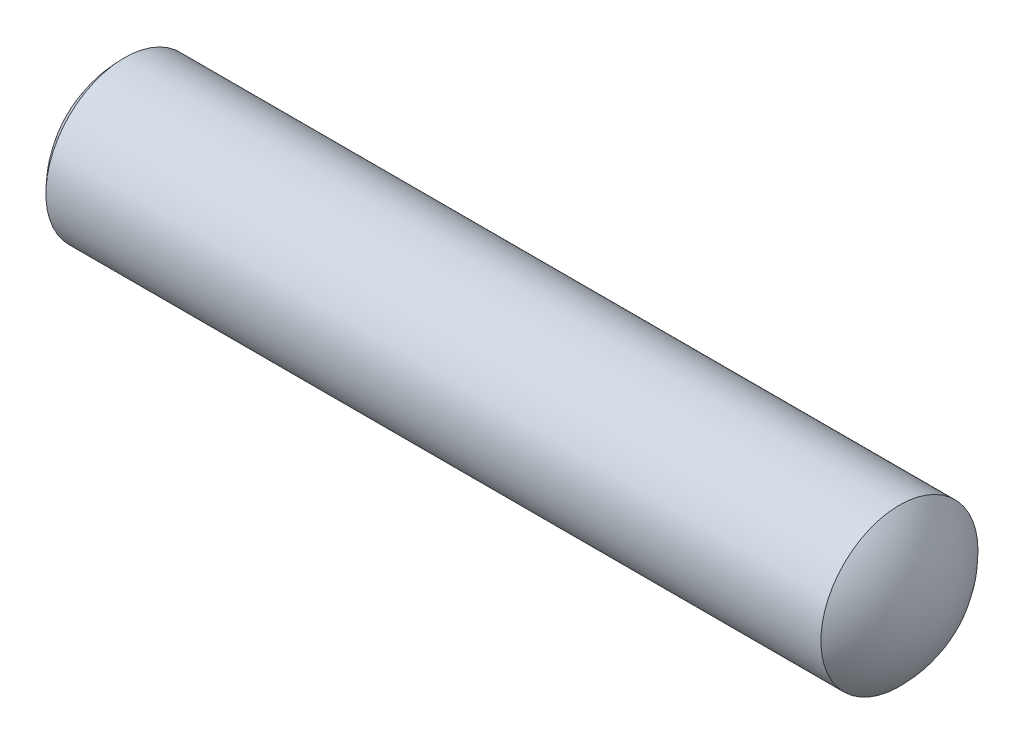
ISO-10303-21;
HEADER;
FILE_DESCRIPTION(('STEP AP214'),'2;1');
FILE_NAME('part.step','',(''),(''),'','','');
FILE_SCHEMA(('AUTOMOTIVE_DESIGN { 1 0 10303 214 1 1 1 1 }'));
ENDSEC;
DATA;
#1=APPLICATION_CONTEXT('core data for automotive mechanical design processes');
#2=APPLICATION_PROTOCOL_DEFINITION('international standard','automotive_design',2000,#1);
#3=PRODUCT_CONTEXT('',#1,'mechanical');
#4=PRODUCT('Part','Part','',(#3));
#5=PRODUCT_RELATED_PRODUCT_CATEGORY('part','',(#4));
#6=PRODUCT_DEFINITION_FORMATION('','',#4);
#7=PRODUCT_DEFINITION_CONTEXT('part definition',#1,'design');
#8=PRODUCT_DEFINITION('design','',#6,#7);
#9=PRODUCT_DEFINITION_SHAPE('','',#8);
#10=(LENGTH_UNIT() NAMED_UNIT(*) SI_UNIT(.MILLI.,.METRE.));
#11=(NAMED_UNIT(*) PLANE_ANGLE_UNIT() SI_UNIT($,.RADIAN.));
#12=(NAMED_UNIT(*) SI_UNIT($,.STERADIAN.) SOLID_ANGLE_UNIT());
#13=UNCERTAINTY_MEASURE_WITH_UNIT(LENGTH_MEASURE(1.E-05),#10,'distance_accuracy_value','');
#14=(GEOMETRIC_REPRESENTATION_CONTEXT(3) GLOBAL_UNCERTAINTY_ASSIGNED_CONTEXT((#13)) GLOBAL_UNIT_ASSIGNED_CONTEXT((#10,
#11,#12)) REPRESENTATION_CONTEXT('',''));
#15=CARTESIAN_POINT('',(0.,0.,0.));
#16=DIRECTION('',(0.,0.,1.));
#17=DIRECTION('',(1.,0.,0.));
#18=AXIS2_PLACEMENT_3D('',#15,#16,#17);
#19=CARTESIAN_POINT('',(15.1875,8.8535324646027,-19.3865319009932));
#20=DIRECTION('',(0.,0.909631995354518,0.415415013001887));
#21=DIRECTION('',(1.,0.,0.));
#22=AXIS2_PLACEMENT_3D('',#19,#20,#21);
#23=SPHERICAL_SURFACE('',#22,1.8375);
#24=CARTESIAN_POINT('',(15.1875,8.8535324646027,-19.3865319009932));
#25=DIRECTION('',(-1.,0.,0.));
#26=DIRECTION('',(0.,-0.415415013001886,0.909631995354519));
#27=AXIS2_PLACEMENT_3D('',#24,#25,#26);
#28=SPHERICAL_SURFACE('',#27,1.8375);
#29=CARTESIAN_POINT('',(16.4734821149612,8.8535324646027,-19.3865319009932));
#30=DIRECTION('',(-1.,0.,0.));
#31=DIRECTION('',(0.,-0.415415013001886,0.909631995354519));
#32=AXIS2_PLACEMENT_3D('',#29,#30,#31);
#33=CIRCLE('',#32,1.3125);
#34=CARTESIAN_POINT('',(16.4734821149612,8.30830026003773,-18.1926399070904));
#35=VERTEX_POINT('',#34);
#36=EDGE_CURVE('E11',#35,#35,#33,.T.);
#37=ORIENTED_EDGE('',*,*,#36,.F.);
#38=EDGE_LOOP('',(#37));
#39=FACE_BOUND('',#38,.T.);
#40=ADVANCED_FACE('F17',(#39),#28,.T.);
#41=CARTESIAN_POINT('',(10.,8.8535324646027,-19.3865319009932));
#42=DIRECTION('',(-1.,0.,0.));
#43=DIRECTION('',(0.,-0.415415013001886,0.909631995354519));
#44=AXIS2_PLACEMENT_3D('',#41,#42,#43);
#45=CYLINDRICAL_SURFACE('',#44,1.3125);
#46=CARTESIAN_POINT('',(3.52651788503884,8.8535324646027,-19.3865319009932));
#47=DIRECTION('',(-1.,0.,0.));
#48=DIRECTION('',(0.,-0.415415013001886,0.909631995354519));
#49=AXIS2_PLACEMENT_3D('',#46,#47,#48);
#50=CIRCLE('',#49,1.3125);
#51=CARTESIAN_POINT('',(3.52651788503884,8.30830026003773,-18.1926399070904));
#52=VERTEX_POINT('',#51);
#53=EDGE_CURVE('E21',#52,#52,#50,.T.);
#54=ORIENTED_EDGE('',*,*,#53,.F.);
#55=EDGE_LOOP('',(#54));
#56=FACE_BOUND('',#55,.T.);
#57=ORIENTED_EDGE('',*,*,#36,.T.);
#58=EDGE_LOOP('',(#57));
#59=FACE_BOUND('',#58,.T.);
#60=ADVANCED_FACE('F47',(#56,#59),#45,.T.);
#61=CARTESIAN_POINT('',(4.8125,8.8535324646027,-19.3865319009932));
#62=DIRECTION('',(0.,0.909631995354518,0.415415013001887));
#63=DIRECTION('',(-1.,0.,0.));
#64=AXIS2_PLACEMENT_3D('',#61,#62,#63);
#65=SPHERICAL_SURFACE('',#64,1.8375);
#66=CARTESIAN_POINT('',(4.8125,8.8535324646027,-19.3865319009932));
#67=DIRECTION('',(-1.,0.,0.));
#68=DIRECTION('',(0.,-0.415415013001886,0.909631995354519));
#69=AXIS2_PLACEMENT_3D('',#66,#67,#68);
#70=SPHERICAL_SURFACE('',#69,1.8375);
#71=ORIENTED_EDGE('',*,*,#53,.T.);
#72=EDGE_LOOP('',(#71));
#73=FACE_BOUND('',#72,.T.);
#74=ADVANCED_FACE('F19',(#73),#70,.T.);
#75=CLOSED_SHELL('',(#40,#60,#74));
#76=MANIFOLD_SOLID_BREP('B1',#75);
#77=ADVANCED_BREP_SHAPE_REPRESENTATION('',(#18,#76),#14);
#78=SHAPE_DEFINITION_REPRESENTATION(#9,#77);
ENDSEC;
END-ISO-10303-21;
